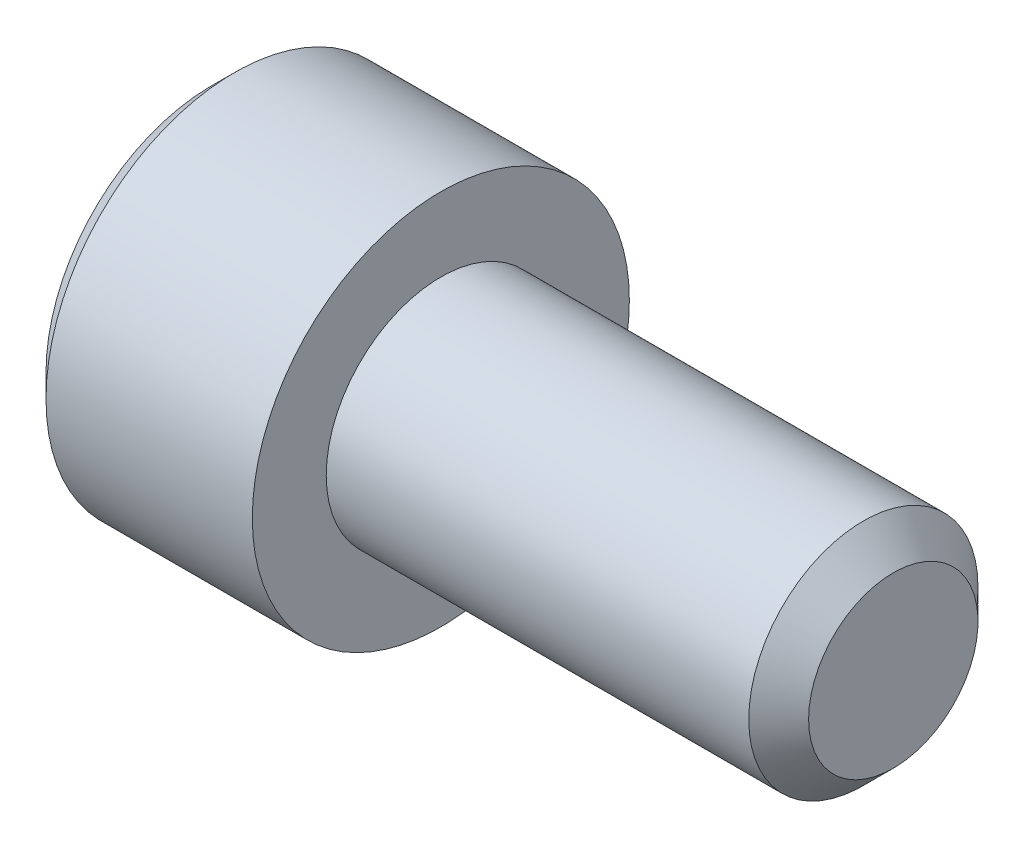
ISO-10303-21;
HEADER;
FILE_DESCRIPTION(('STEP AP214'),'2;1');
FILE_NAME('part.step','',(''),(''),'','','');
FILE_SCHEMA(('AUTOMOTIVE_DESIGN { 1 0 10303 214 1 1 1 1 }'));
ENDSEC;
DATA;
#1=APPLICATION_CONTEXT('core data for automotive mechanical design processes');
#2=APPLICATION_PROTOCOL_DEFINITION('international standard','automotive_design',2000,#1);
#3=PRODUCT_CONTEXT('',#1,'mechanical');
#4=PRODUCT('Part','Part','',(#3));
#5=PRODUCT_RELATED_PRODUCT_CATEGORY('part','',(#4));
#6=PRODUCT_DEFINITION_FORMATION('','',#4);
#7=PRODUCT_DEFINITION_CONTEXT('part definition',#1,'design');
#8=PRODUCT_DEFINITION('design','',#6,#7);
#9=PRODUCT_DEFINITION_SHAPE('','',#8);
#10=(LENGTH_UNIT() NAMED_UNIT(*) SI_UNIT(.MILLI.,.METRE.));
#11=(NAMED_UNIT(*) PLANE_ANGLE_UNIT() SI_UNIT($,.RADIAN.));
#12=(NAMED_UNIT(*) SI_UNIT($,.STERADIAN.) SOLID_ANGLE_UNIT());
#13=UNCERTAINTY_MEASURE_WITH_UNIT(LENGTH_MEASURE(1.E-05),#10,'distance_accuracy_value','');
#14=(GEOMETRIC_REPRESENTATION_CONTEXT(3) GLOBAL_UNCERTAINTY_ASSIGNED_CONTEXT((#13)) GLOBAL_UNIT_ASSIGNED_CONTEXT((#10,
#11,#12)) REPRESENTATION_CONTEXT('',''));
#15=CARTESIAN_POINT('',(0.,0.,0.));
#16=DIRECTION('',(0.,0.,1.));
#17=DIRECTION('',(1.,0.,0.));
#18=AXIS2_PLACEMENT_3D('',#15,#16,#17);
#19=CARTESIAN_POINT('',(0.,0.,0.));
#20=DIRECTION('',(-1.,0.,0.));
#21=DIRECTION('',(0.,0.,1.));
#22=AXIS2_PLACEMENT_3D('',#19,#20,#21);
#23=PLANE('',#22);
#24=DIRECTION('',(0.,-0.499999999999996,0.866025403784442));
#25=VECTOR('',#24,1.);
#26=CARTESIAN_POINT('',(0.,2.29209211568815,0.));
#27=LINE('',#26,#25);
#28=CARTESIAN_POINT('',(0.,2.29209211568815,0.));
#29=VERTEX_POINT('',#28);
#30=CARTESIAN_POINT('',(0.,1.14604605784413,1.98501000000001));
#31=VERTEX_POINT('',#30);
#32=EDGE_CURVE('E183',#29,#31,#27,.T.);
#33=ORIENTED_EDGE('',*,*,#32,.T.);
#34=DIRECTION('',(0.,1.,0.));
#35=VECTOR('',#34,1.);
#36=CARTESIAN_POINT('',(0.,-1.14604605784413,1.98501000000012));
#37=LINE('',#36,#35);
#38=CARTESIAN_POINT('',(0.,-1.14604605784413,1.98501000000012));
#39=VERTEX_POINT('',#38);
#40=EDGE_CURVE('E136',#39,#31,#37,.T.);
#41=ORIENTED_EDGE('',*,*,#40,.F.);
#42=DIRECTION('',(0.,-0.500000000000003,-0.866025403784441));
#43=VECTOR('',#42,1.);
#44=CARTESIAN_POINT('',(0.,-1.14604605784413,1.98501000000012));
#45=LINE('',#44,#43);
#46=CARTESIAN_POINT('',(0.,-2.2920921156882,1.11022302462516E-13));
#47=VERTEX_POINT('',#46);
#48=EDGE_CURVE('E189',#39,#47,#45,.T.);
#49=ORIENTED_EDGE('',*,*,#48,.T.);
#50=DIRECTION('',(0.,0.499999999999996,-0.866025403784442));
#51=VECTOR('',#50,1.);
#52=CARTESIAN_POINT('',(0.,-2.2920921156882,1.11022302462516E-13));
#53=LINE('',#52,#51);
#54=CARTESIAN_POINT('',(0.,-1.14604605784419,-1.98501000000001));
#55=VERTEX_POINT('',#54);
#56=EDGE_CURVE('E196',#47,#55,#53,.T.);
#57=ORIENTED_EDGE('',*,*,#56,.T.);
#58=DIRECTION('',(0.,-1.,0.));
#59=VECTOR('',#58,1.);
#60=CARTESIAN_POINT('',(0.,1.14604605784402,-1.98501000000001));
#61=LINE('',#60,#59);
#62=CARTESIAN_POINT('',(0.,1.14604605784402,-1.98501000000001));
#63=VERTEX_POINT('',#62);
#64=EDGE_CURVE('E199',#63,#55,#61,.T.);
#65=ORIENTED_EDGE('',*,*,#64,.F.);
#66=DIRECTION('',(0.,-0.500000000000004,-0.866025403784441));
#67=VECTOR('',#66,1.);
#68=CARTESIAN_POINT('',(0.,2.29209211568815,0.));
#69=LINE('',#68,#67);
#70=EDGE_CURVE('E131',#29,#63,#69,.T.);
#71=ORIENTED_EDGE('',*,*,#70,.F.);
#72=EDGE_LOOP('',(#33,#41,#49,#57,#65,#71));
#73=FACE_BOUND('',#72,.T.);
#74=CARTESIAN_POINT('',(0.,0.,0.));
#75=DIRECTION('',(-1.,0.,0.));
#76=DIRECTION('',(0.,0.,1.));
#77=AXIS2_PLACEMENT_3D('',#74,#75,#76);
#78=CIRCLE('',#77,3.48615);
#79=CARTESIAN_POINT('',(0.,0.,3.48615000000001));
#80=VERTEX_POINT('',#79);
#81=EDGE_CURVE('E13',#80,#80,#78,.T.);
#82=ORIENTED_EDGE('',*,*,#81,.T.);
#83=EDGE_LOOP('',(#82));
#84=FACE_BOUND('',#83,.T.);
#85=ADVANCED_FACE('F45',(#73,#84),#23,.T.);
#86=CARTESIAN_POINT('',(0.,0.,0.));
#87=DIRECTION('',(1.,0.,0.));
#88=DIRECTION('',(0.,0.,-1.));
#89=AXIS2_PLACEMENT_3D('',#86,#87,#88);
#90=CONICAL_SURFACE('',#89,3.48615,0.785398163397449);
#91=CARTESIAN_POINT('',(0.4826,0.,0.));
#92=DIRECTION('',(-1.,0.,0.));
#93=DIRECTION('',(0.,0.,1.));
#94=AXIS2_PLACEMENT_3D('',#91,#92,#93);
#95=CIRCLE('',#94,3.96875);
#96=CARTESIAN_POINT('',(0.4826,0.,3.96875000000001));
#97=VERTEX_POINT('',#96);
#98=EDGE_CURVE('E52',#97,#97,#95,.T.);
#99=ORIENTED_EDGE('',*,*,#98,.T.);
#100=EDGE_LOOP('',(#99));
#101=FACE_BOUND('',#100,.T.);
#102=ORIENTED_EDGE('',*,*,#81,.F.);
#103=EDGE_LOOP('',(#102));
#104=FACE_BOUND('',#103,.T.);
#105=ADVANCED_FACE('F162',(#101,#104),#90,.T.);
#106=CARTESIAN_POINT('',(-31.7499999999999,0.,1.11022302462516E-13));
#107=DIRECTION('',(-1.,0.,0.));
#108=DIRECTION('',(0.,0.,1.));
#109=AXIS2_PLACEMENT_3D('',#106,#107,#108);
#110=CYLINDRICAL_SURFACE('',#109,3.96875);
#111=CARTESIAN_POINT('',(4.826,0.,0.));
#112=DIRECTION('',(-1.,0.,0.));
#113=DIRECTION('',(0.,0.,1.));
#114=AXIS2_PLACEMENT_3D('',#111,#112,#113);
#115=CIRCLE('',#114,3.96875);
#116=CARTESIAN_POINT('',(4.826,0.,3.96875000000001));
#117=VERTEX_POINT('',#116);
#118=EDGE_CURVE('E157',#117,#117,#115,.T.);
#119=ORIENTED_EDGE('',*,*,#118,.T.);
#120=EDGE_LOOP('',(#119));
#121=FACE_BOUND('',#120,.T.);
#122=ORIENTED_EDGE('',*,*,#98,.F.);
#123=EDGE_LOOP('',(#122));
#124=FACE_BOUND('',#123,.T.);
#125=ADVANCED_FACE('F165',(#121,#124),#110,.T.);
#126=CARTESIAN_POINT('',(4.826,3.96874999999997,2.22044604925031E-13));
#127=DIRECTION('',(1.,0.,0.));
#128=DIRECTION('',(0.,0.,-1.));
#129=AXIS2_PLACEMENT_3D('',#126,#127,#128);
#130=PLANE('',#129);
#131=CARTESIAN_POINT('',(4.826,0.,0.));
#132=DIRECTION('',(-1.,0.,0.));
#133=DIRECTION('',(0.,0.,1.));
#134=AXIS2_PLACEMENT_3D('',#131,#132,#133);
#135=CIRCLE('',#134,2.413);
#136=CARTESIAN_POINT('',(4.826,0.,2.41300000000001));
#137=VERTEX_POINT('',#136);
#138=EDGE_CURVE('E154',#137,#137,#135,.T.);
#139=ORIENTED_EDGE('',*,*,#138,.T.);
#140=EDGE_LOOP('',(#139));
#141=FACE_BOUND('',#140,.T.);
#142=ORIENTED_EDGE('',*,*,#118,.F.);
#143=EDGE_LOOP('',(#142));
#144=FACE_BOUND('',#143,.T.);
#145=ADVANCED_FACE('F167',(#141,#144),#130,.T.);
#146=CARTESIAN_POINT('',(-31.7499999999999,0.,1.11022302462516E-13));
#147=DIRECTION('',(-1.,0.,0.));
#148=DIRECTION('',(0.,0.,1.));
#149=AXIS2_PLACEMENT_3D('',#146,#147,#148);
#150=CYLINDRICAL_SURFACE('',#149,2.41299999999998);
#151=CARTESIAN_POINT('',(13.72108,0.,0.));
#152=DIRECTION('',(-1.,0.,0.));
#153=DIRECTION('',(0.,0.,1.));
#154=AXIS2_PLACEMENT_3D('',#151,#152,#153);
#155=CIRCLE('',#154,2.41299999999997);
#156=CARTESIAN_POINT('',(13.72108,0.,2.41299999999997));
#157=VERTEX_POINT('',#156);
#158=EDGE_CURVE('E151',#157,#157,#155,.T.);
#159=ORIENTED_EDGE('',*,*,#158,.T.);
#160=EDGE_LOOP('',(#159));
#161=FACE_BOUND('',#160,.T.);
#162=ORIENTED_EDGE('',*,*,#138,.F.);
#163=EDGE_LOOP('',(#162));
#164=FACE_BOUND('',#163,.T.);
#165=ADVANCED_FACE('F174',(#161,#164),#150,.T.);
#166=CARTESIAN_POINT('',(14.351,0.,0.));
#167=DIRECTION('',(-1.,0.,0.));
#168=DIRECTION('',(0.,0.,1.));
#169=AXIS2_PLACEMENT_3D('',#166,#167,#168);
#170=CONICAL_SURFACE('',#169,1.78308,0.785398163397401);
#171=ORIENTED_EDGE('',*,*,#158,.F.);
#172=EDGE_LOOP('',(#171));
#173=FACE_BOUND('',#172,.T.);
#174=CARTESIAN_POINT('',(14.351,0.,0.));
#175=DIRECTION('',(-1.,0.,0.));
#176=DIRECTION('',(0.,0.,1.));
#177=AXIS2_PLACEMENT_3D('',#174,#175,#176);
#178=CIRCLE('',#177,1.78308);
#179=CARTESIAN_POINT('',(14.351,0.,1.78308));
#180=VERTEX_POINT('',#179);
#181=EDGE_CURVE('E147',#180,#180,#178,.T.);
#182=ORIENTED_EDGE('',*,*,#181,.T.);
#183=EDGE_LOOP('',(#182));
#184=FACE_BOUND('',#183,.T.);
#185=ADVANCED_FACE('F347',(#173,#184),#170,.T.);
#186=CARTESIAN_POINT('',(14.351,1.78307999999999,0.));
#187=DIRECTION('',(1.,0.,0.));
#188=DIRECTION('',(0.,0.,-1.));
#189=AXIS2_PLACEMENT_3D('',#186,#187,#188);
#190=PLANE('',#189);
#191=ORIENTED_EDGE('',*,*,#181,.F.);
#192=EDGE_LOOP('',(#191));
#193=FACE_BOUND('',#192,.T.);
#194=ADVANCED_FACE('F337',(#193),#190,.T.);
#195=CARTESIAN_POINT('',(2.28600000000001,2.29209211568815,0.));
#196=DIRECTION('',(0.,-0.866025403784442,-0.5));
#197=DIRECTION('',(0.,0.499999999999996,-0.866025403784442));
#198=AXIS2_PLACEMENT_3D('',#195,#196,#197);
#199=PLANE('',#198);
#200=ORIENTED_EDGE('',*,*,#32,.F.);
#201=DIRECTION('',(-1.,0.,0.));
#202=VECTOR('',#201,1.);
#203=CARTESIAN_POINT('',(2.28600000000001,2.29209211568815,0.));
#204=LINE('',#203,#202);
#205=CARTESIAN_POINT('',(2.28600000000001,2.29209211568815,0.));
#206=VERTEX_POINT('',#205);
#207=EDGE_CURVE('E202',#206,#29,#204,.T.);
#208=ORIENTED_EDGE('',*,*,#207,.F.);
#209=DIRECTION('',(0.,-0.499999999999996,0.866025403784442));
#210=VECTOR('',#209,1.);
#211=CARTESIAN_POINT('',(2.28600000000001,2.29209211568815,0.));
#212=LINE('',#211,#210);
#213=CARTESIAN_POINT('',(2.28600000000001,1.71906908676611,0.992504999999977));
#214=VERTEX_POINT('',#213);
#215=EDGE_CURVE('E59',#206,#214,#212,.T.);
#216=ORIENTED_EDGE('',*,*,#215,.T.);
#217=CARTESIAN_POINT('',(2.28600000000001,1.14604605784413,1.98501000000001));
#218=VERTEX_POINT('',#217);
#219=EDGE_CURVE('E117',#214,#218,#212,.T.);
#220=ORIENTED_EDGE('',*,*,#219,.T.);
#221=DIRECTION('',(-1.,0.,0.));
#222=VECTOR('',#221,1.);
#223=CARTESIAN_POINT('',(2.28600000000001,1.14604605784413,1.98501000000001));
#224=LINE('',#223,#222);
#225=EDGE_CURVE('E129',#218,#31,#224,.T.);
#226=ORIENTED_EDGE('',*,*,#225,.T.);
#227=EDGE_LOOP('',(#200,#208,#216,#220,#226));
#228=FACE_BOUND('',#227,.T.);
#229=ADVANCED_FACE('F128',(#228),#199,.T.);
#230=CARTESIAN_POINT('',(2.28600000000001,-1.14604605784413,1.98501000000012));
#231=DIRECTION('',(0.,0.,1.));
#232=DIRECTION('',(0.,-1.,0.));
#233=AXIS2_PLACEMENT_3D('',#230,#231,#232);
#234=PLANE('',#233);
#235=ORIENTED_EDGE('',*,*,#40,.T.);
#236=ORIENTED_EDGE('',*,*,#225,.F.);
#237=DIRECTION('',(0.,1.,0.));
#238=VECTOR('',#237,1.);
#239=CARTESIAN_POINT('',(2.28600000000001,-1.14604605784413,1.98501000000012));
#240=LINE('',#239,#238);
#241=CARTESIAN_POINT('',(2.28600000000001,0.,1.98501000000001));
#242=VERTEX_POINT('',#241);
#243=EDGE_CURVE('E115',#242,#218,#240,.T.);
#244=ORIENTED_EDGE('',*,*,#243,.F.);
#245=CARTESIAN_POINT('',(2.28600000000001,-1.14604605784413,1.98501000000012));
#246=VERTEX_POINT('',#245);
#247=EDGE_CURVE('E125',#246,#242,#240,.T.);
#248=ORIENTED_EDGE('',*,*,#247,.F.);
#249=DIRECTION('',(-1.,0.,0.));
#250=VECTOR('',#249,1.);
#251=CARTESIAN_POINT('',(2.28600000000001,-1.14604605784413,1.98501000000012));
#252=LINE('',#251,#250);
#253=EDGE_CURVE('E138',#246,#39,#252,.T.);
#254=ORIENTED_EDGE('',*,*,#253,.T.);
#255=EDGE_LOOP('',(#235,#236,#244,#248,#254));
#256=FACE_BOUND('',#255,.T.);
#257=ADVANCED_FACE('F133',(#256),#234,.F.);
#258=CARTESIAN_POINT('',(2.28600000000001,-1.14604605784413,1.98501000000012));
#259=DIRECTION('',(0.,0.866025403784438,-0.500000000000001));
#260=DIRECTION('',(0.,0.500000000000004,0.866025403784441));
#261=AXIS2_PLACEMENT_3D('',#258,#259,#260);
#262=PLANE('',#261);
#263=ORIENTED_EDGE('',*,*,#48,.F.);
#264=ORIENTED_EDGE('',*,*,#253,.F.);
#265=DIRECTION('',(0.,-0.500000000000003,-0.866025403784441));
#266=VECTOR('',#265,1.);
#267=CARTESIAN_POINT('',(2.28600000000001,-1.14604605784413,1.98501000000012));
#268=LINE('',#267,#266);
#269=CARTESIAN_POINT('',(2.28600000000001,-1.71906908676617,0.992505000000143));
#270=VERTEX_POINT('',#269);
#271=EDGE_CURVE('E242',#246,#270,#268,.T.);
#272=ORIENTED_EDGE('',*,*,#271,.T.);
#273=CARTESIAN_POINT('',(2.28600000000001,-2.2920921156882,1.11022302462516E-13));
#274=VERTEX_POINT('',#273);
#275=EDGE_CURVE('E215',#270,#274,#268,.T.);
#276=ORIENTED_EDGE('',*,*,#275,.T.);
#277=DIRECTION('',(-1.,0.,0.));
#278=VECTOR('',#277,1.);
#279=CARTESIAN_POINT('',(2.28600000000001,-2.2920921156882,1.11022302462516E-13));
#280=LINE('',#279,#278);
#281=EDGE_CURVE('E143',#274,#47,#280,.T.);
#282=ORIENTED_EDGE('',*,*,#281,.T.);
#283=EDGE_LOOP('',(#263,#264,#272,#276,#282));
#284=FACE_BOUND('',#283,.T.);
#285=ADVANCED_FACE('F212',(#284),#262,.T.);
#286=CARTESIAN_POINT('',(2.28600000000001,-2.2920921156882,1.11022302462516E-13));
#287=DIRECTION('',(0.,0.866025403784442,0.5));
#288=DIRECTION('',(0.,-0.499999999999996,0.866025403784442));
#289=AXIS2_PLACEMENT_3D('',#286,#287,#288);
#290=PLANE('',#289);
#291=ORIENTED_EDGE('',*,*,#56,.F.);
#292=ORIENTED_EDGE('',*,*,#281,.F.);
#293=DIRECTION('',(0.,0.499999999999996,-0.866025403784442));
#294=VECTOR('',#293,1.);
#295=CARTESIAN_POINT('',(2.28600000000001,-2.2920921156882,1.11022302462516E-13));
#296=LINE('',#295,#294);
#297=CARTESIAN_POINT('',(2.28600000000001,-1.71906908676622,-0.992504999999866));
#298=VERTEX_POINT('',#297);
#299=EDGE_CURVE('E244',#274,#298,#296,.T.);
#300=ORIENTED_EDGE('',*,*,#299,.T.);
#301=CARTESIAN_POINT('',(2.28600000000001,-1.14604605784419,-1.98501000000001));
#302=VERTEX_POINT('',#301);
#303=EDGE_CURVE('E223',#298,#302,#296,.T.);
#304=ORIENTED_EDGE('',*,*,#303,.T.);
#305=DIRECTION('',(-1.,0.,0.));
#306=VECTOR('',#305,1.);
#307=CARTESIAN_POINT('',(2.28600000000001,-1.14604605784419,-1.98501000000001));
#308=LINE('',#307,#306);
#309=EDGE_CURVE('E207',#302,#55,#308,.T.);
#310=ORIENTED_EDGE('',*,*,#309,.T.);
#311=EDGE_LOOP('',(#291,#292,#300,#304,#310));
#312=FACE_BOUND('',#311,.T.);
#313=ADVANCED_FACE('F219',(#312),#290,.T.);
#314=CARTESIAN_POINT('',(2.28600000000001,1.14604605784402,-1.98501000000001));
#315=DIRECTION('',(0.,0.,-1.));
#316=DIRECTION('',(0.,1.,0.));
#317=AXIS2_PLACEMENT_3D('',#314,#315,#316);
#318=PLANE('',#317);
#319=ORIENTED_EDGE('',*,*,#64,.T.);
#320=ORIENTED_EDGE('',*,*,#309,.F.);
#321=DIRECTION('',(0.,-1.,0.));
#322=VECTOR('',#321,1.);
#323=CARTESIAN_POINT('',(2.28600000000001,1.14604605784402,-1.98501000000001));
#324=LINE('',#323,#322);
#325=CARTESIAN_POINT('',(2.28600000000001,0.,-1.98501000000001));
#326=VERTEX_POINT('',#325);
#327=EDGE_CURVE('E228',#326,#302,#324,.T.);
#328=ORIENTED_EDGE('',*,*,#327,.F.);
#329=CARTESIAN_POINT('',(2.28600000000001,1.14604605784402,-1.98501000000001));
#330=VERTEX_POINT('',#329);
#331=EDGE_CURVE('E231',#330,#326,#324,.T.);
#332=ORIENTED_EDGE('',*,*,#331,.F.);
#333=DIRECTION('',(-1.,0.,0.));
#334=VECTOR('',#333,1.);
#335=CARTESIAN_POINT('',(2.28600000000001,1.14604605784402,-1.98501000000001));
#336=LINE('',#335,#334);
#337=EDGE_CURVE('E204',#330,#63,#336,.T.);
#338=ORIENTED_EDGE('',*,*,#337,.T.);
#339=EDGE_LOOP('',(#319,#320,#328,#332,#338));
#340=FACE_BOUND('',#339,.T.);
#341=ADVANCED_FACE('F226',(#340),#318,.F.);
#342=CARTESIAN_POINT('',(2.28600000000001,2.29209211568815,0.));
#343=DIRECTION('',(0.,0.866025403784438,-0.500000000000002));
#344=DIRECTION('',(0.,0.500000000000004,0.866025403784441));
#345=AXIS2_PLACEMENT_3D('',#342,#343,#344);
#346=PLANE('',#345);
#347=ORIENTED_EDGE('',*,*,#70,.T.);
#348=ORIENTED_EDGE('',*,*,#337,.F.);
#349=DIRECTION('',(0.,-0.500000000000004,-0.866025403784441));
#350=VECTOR('',#349,1.);
#351=CARTESIAN_POINT('',(2.28600000000001,2.29209211568815,0.));
#352=LINE('',#351,#350);
#353=CARTESIAN_POINT('',(2.28600000000001,1.71906908676617,-0.992505000000032));
#354=VERTEX_POINT('',#353);
#355=EDGE_CURVE('E236',#354,#330,#352,.T.);
#356=ORIENTED_EDGE('',*,*,#355,.F.);
#357=EDGE_CURVE('E192',#206,#354,#352,.T.);
#358=ORIENTED_EDGE('',*,*,#357,.F.);
#359=ORIENTED_EDGE('',*,*,#207,.T.);
#360=EDGE_LOOP('',(#347,#348,#356,#358,#359));
#361=FACE_BOUND('',#360,.T.);
#362=ADVANCED_FACE('F234',(#361),#346,.F.);
#363=CARTESIAN_POINT('',(2.28600000000001,1.14604605784413,1.98501000000001));
#364=DIRECTION('',(-1.,0.,0.));
#365=DIRECTION('',(0.,0.,1.));
#366=AXIS2_PLACEMENT_3D('',#363,#364,#365);
#367=PLANE('',#366);
#368=CARTESIAN_POINT('',(2.28600000000001,0.,0.));
#369=DIRECTION('',(-1.,0.,0.));
#370=DIRECTION('',(0.,0.,1.));
#371=AXIS2_PLACEMENT_3D('',#368,#369,#370);
#372=CIRCLE('',#371,1.98501);
#373=EDGE_CURVE('E137',#270,#242,#372,.T.);
#374=ORIENTED_EDGE('',*,*,#373,.F.);
#375=ORIENTED_EDGE('',*,*,#271,.F.);
#376=ORIENTED_EDGE('',*,*,#247,.T.);
#377=EDGE_LOOP('',(#374,#375,#376));
#378=FACE_BOUND('',#377,.T.);
#379=ADVANCED_FACE('F259',(#378),#367,.T.);
#380=EDGE_CURVE('E141',#298,#270,#372,.T.);
#381=ORIENTED_EDGE('',*,*,#380,.F.);
#382=ORIENTED_EDGE('',*,*,#299,.F.);
#383=ORIENTED_EDGE('',*,*,#275,.F.);
#384=EDGE_LOOP('',(#381,#382,#383));
#385=FACE_BOUND('',#384,.T.);
#386=ADVANCED_FACE('F256',(#385),#367,.T.);
#387=EDGE_CURVE('E250',#326,#298,#372,.T.);
#388=ORIENTED_EDGE('',*,*,#387,.F.);
#389=ORIENTED_EDGE('',*,*,#327,.T.);
#390=ORIENTED_EDGE('',*,*,#303,.F.);
#391=EDGE_LOOP('',(#388,#389,#390));
#392=FACE_BOUND('',#391,.T.);
#393=ADVANCED_FACE('F248',(#392),#367,.T.);
#394=EDGE_CURVE('E253',#354,#326,#372,.T.);
#395=ORIENTED_EDGE('',*,*,#394,.F.);
#396=ORIENTED_EDGE('',*,*,#355,.T.);
#397=ORIENTED_EDGE('',*,*,#331,.T.);
#398=EDGE_LOOP('',(#395,#396,#397));
#399=FACE_BOUND('',#398,.T.);
#400=ADVANCED_FACE('F273',(#399),#367,.T.);
#401=EDGE_CURVE('E148',#214,#354,#372,.T.);
#402=ORIENTED_EDGE('',*,*,#401,.F.);
#403=ORIENTED_EDGE('',*,*,#215,.F.);
#404=ORIENTED_EDGE('',*,*,#357,.T.);
#405=EDGE_LOOP('',(#402,#403,#404));
#406=FACE_BOUND('',#405,.T.);
#407=ADVANCED_FACE('F239',(#406),#367,.T.);
#408=EDGE_CURVE('E120',#242,#214,#372,.T.);
#409=ORIENTED_EDGE('',*,*,#408,.F.);
#410=ORIENTED_EDGE('',*,*,#243,.T.);
#411=ORIENTED_EDGE('',*,*,#219,.F.);
#412=EDGE_LOOP('',(#409,#410,#411));
#413=FACE_BOUND('',#412,.T.);
#414=ADVANCED_FACE('F116',(#413),#367,.T.);
#415=CARTESIAN_POINT('',(2.28600000000001,0.,0.));
#416=DIRECTION('',(-1.,0.,0.));
#417=DIRECTION('',(0.,0.,1.));
#418=AXIS2_PLACEMENT_3D('',#415,#416,#417);
#419=CONICAL_SURFACE('',#418,1.98501,1.04719755119659);
#420=CARTESIAN_POINT('',(3.43204605784414,0.,0.));
#421=VERTEX_POINT('',#420);
#422=VERTEX_LOOP('',#421);
#423=FACE_BOUND('',#422,.T.);
#424=ORIENTED_EDGE('',*,*,#408,.T.);
#425=ORIENTED_EDGE('',*,*,#401,.T.);
#426=ORIENTED_EDGE('',*,*,#394,.T.);
#427=ORIENTED_EDGE('',*,*,#387,.T.);
#428=ORIENTED_EDGE('',*,*,#380,.T.);
#429=ORIENTED_EDGE('',*,*,#373,.T.);
#430=EDGE_LOOP('',(#424,#425,#426,#427,#428,#429));
#431=FACE_BOUND('',#430,.T.);
#432=ADVANCED_FACE('F254',(#423,#431),#419,.F.);
#433=CLOSED_SHELL('',(#85,#105,#125,#145,#165,#185,#194,#229,#257,#285,#313,#341,#362,#379,#386,
#393,#400,#407,#414,#432));
#434=MANIFOLD_SOLID_BREP('B2',#433);
#435=ADVANCED_BREP_SHAPE_REPRESENTATION('',(#18,#434),#14);
#436=SHAPE_DEFINITION_REPRESENTATION(#9,#435);
ENDSEC;
END-ISO-10303-21;
